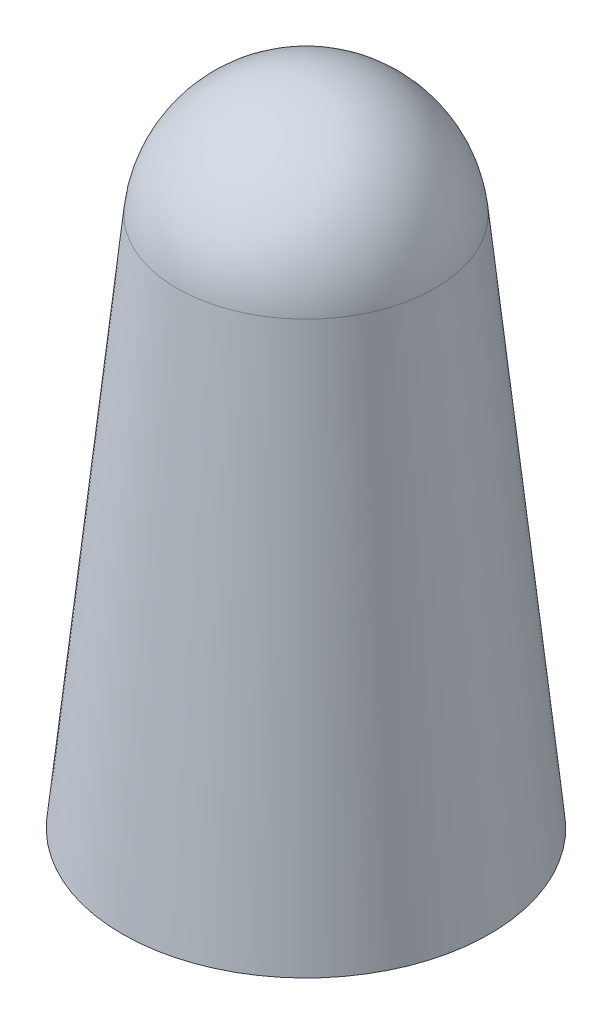
ISO-10303-21;
HEADER;
FILE_DESCRIPTION(('STEP AP214'),'2;1');
FILE_NAME('part.step','',(''),(''),'','','');
FILE_SCHEMA(('AUTOMOTIVE_DESIGN { 1 0 10303 214 1 1 1 1 }'));
ENDSEC;
DATA;
#1=APPLICATION_CONTEXT('core data for automotive mechanical design processes');
#2=APPLICATION_PROTOCOL_DEFINITION('international standard','automotive_design',2000,#1);
#3=PRODUCT_CONTEXT('',#1,'mechanical');
#4=PRODUCT('Part','Part','',(#3));
#5=PRODUCT_RELATED_PRODUCT_CATEGORY('part','',(#4));
#6=PRODUCT_DEFINITION_FORMATION('','',#4);
#7=PRODUCT_DEFINITION_CONTEXT('part definition',#1,'design');
#8=PRODUCT_DEFINITION('design','',#6,#7);
#9=PRODUCT_DEFINITION_SHAPE('','',#8);
#10=(LENGTH_UNIT() NAMED_UNIT(*) SI_UNIT(.MILLI.,.METRE.));
#11=(NAMED_UNIT(*) PLANE_ANGLE_UNIT() SI_UNIT($,.RADIAN.));
#12=(NAMED_UNIT(*) SI_UNIT($,.STERADIAN.) SOLID_ANGLE_UNIT());
#13=UNCERTAINTY_MEASURE_WITH_UNIT(LENGTH_MEASURE(1.E-05),#10,'distance_accuracy_value','');
#14=(GEOMETRIC_REPRESENTATION_CONTEXT(3) GLOBAL_UNCERTAINTY_ASSIGNED_CONTEXT((#13)) GLOBAL_UNIT_ASSIGNED_CONTEXT((#10,
#11,#12)) REPRESENTATION_CONTEXT('',''));
#15=CARTESIAN_POINT('',(0.,0.,0.));
#16=DIRECTION('',(0.,0.,1.));
#17=DIRECTION('',(1.,0.,0.));
#18=AXIS2_PLACEMENT_3D('',#15,#16,#17);
#19=CARTESIAN_POINT('',(0.,0.,0.));
#20=DIRECTION('',(0.,-1.,0.));
#21=DIRECTION('',(0.,0.,-1.));
#22=AXIS2_PLACEMENT_3D('',#19,#20,#21);
#23=CYLINDRICAL_SURFACE('',#22,2.5);
#24=CARTESIAN_POINT('',(0.,6.,0.));
#25=DIRECTION('',(0.,-1.,0.));
#26=DIRECTION('',(0.,0.,-1.));
#27=AXIS2_PLACEMENT_3D('',#24,#25,#26);
#28=CIRCLE('',#27,2.5);
#29=CARTESIAN_POINT('',(0.,6.,-2.5));
#30=VERTEX_POINT('',#29);
#31=EDGE_CURVE('E10',#30,#30,#28,.T.);
#32=ORIENTED_EDGE('',*,*,#31,.F.);
#33=EDGE_LOOP('',(#32));
#34=FACE_BOUND('',#33,.T.);
#35=CARTESIAN_POINT('',(0.,0.,0.));
#36=DIRECTION('',(0.,-1.,0.));
#37=DIRECTION('',(0.,0.,-1.));
#38=AXIS2_PLACEMENT_3D('',#35,#36,#37);
#39=CIRCLE('',#38,2.5);
#40=CARTESIAN_POINT('',(0.,0.,-2.5));
#41=VERTEX_POINT('',#40);
#42=EDGE_CURVE('E46',#41,#41,#39,.T.);
#43=ORIENTED_EDGE('',*,*,#42,.T.);
#44=EDGE_LOOP('',(#43));
#45=FACE_BOUND('',#44,.T.);
#46=ADVANCED_FACE('F24',(#34,#45),#23,.F.);
#47=CARTESIAN_POINT('',(-2.5,6.,0.));
#48=DIRECTION('',(0.,1.,0.));
#49=DIRECTION('',(0.,0.,1.));
#50=AXIS2_PLACEMENT_3D('',#47,#48,#49);
#51=PLANE('',#50);
#52=CARTESIAN_POINT('',(0.,6.,0.));
#53=DIRECTION('',(0.,-1.,0.));
#54=DIRECTION('',(0.,0.,-1.));
#55=AXIS2_PLACEMENT_3D('',#52,#53,#54);
#56=CIRCLE('',#55,2.);
#57=CARTESIAN_POINT('',(0.,6.,-2.));
#58=VERTEX_POINT('',#57);
#59=EDGE_CURVE('E30',#58,#58,#56,.T.);
#60=ORIENTED_EDGE('',*,*,#59,.F.);
#61=EDGE_LOOP('',(#60));
#62=FACE_BOUND('',#61,.T.);
#63=ORIENTED_EDGE('',*,*,#31,.T.);
#64=EDGE_LOOP('',(#63));
#65=FACE_BOUND('',#64,.T.);
#66=ADVANCED_FACE('F74',(#62,#65),#51,.F.);
#67=CARTESIAN_POINT('',(0.,0.,0.));
#68=DIRECTION('',(0.,-1.,0.));
#69=DIRECTION('',(0.,0.,-1.));
#70=AXIS2_PLACEMENT_3D('',#67,#68,#69);
#71=CYLINDRICAL_SURFACE('',#70,2.);
#72=CARTESIAN_POINT('',(0.,12.,0.));
#73=DIRECTION('',(0.,-1.,0.));
#74=DIRECTION('',(0.,0.,-1.));
#75=AXIS2_PLACEMENT_3D('',#72,#73,#74);
#76=CIRCLE('',#75,2.);
#77=CARTESIAN_POINT('',(0.,12.,-2.));
#78=VERTEX_POINT('',#77);
#79=EDGE_CURVE('E34',#78,#78,#76,.T.);
#80=ORIENTED_EDGE('',*,*,#79,.F.);
#81=EDGE_LOOP('',(#80));
#82=FACE_BOUND('',#81,.T.);
#83=ORIENTED_EDGE('',*,*,#59,.T.);
#84=EDGE_LOOP('',(#83));
#85=FACE_BOUND('',#84,.T.);
#86=ADVANCED_FACE('F70',(#82,#85),#71,.F.);
#87=CARTESIAN_POINT('',(0.,12.,0.));
#88=DIRECTION('',(0.,-1.,0.));
#89=DIRECTION('',(-1.,0.,0.));
#90=AXIS2_PLACEMENT_3D('',#87,#88,#89);
#91=SPHERICAL_SURFACE('',#90,2.);
#92=ORIENTED_EDGE('',*,*,#79,.T.);
#93=EDGE_LOOP('',(#92));
#94=FACE_BOUND('',#93,.T.);
#95=ADVANCED_FACE('F65',(#94),#91,.F.);
#96=CARTESIAN_POINT('',(0.,12.,0.));
#97=DIRECTION('',(0.,-1.,0.));
#98=DIRECTION('',(1.,0.,0.));
#99=AXIS2_PLACEMENT_3D('',#96,#97,#98);
#100=SPHERICAL_SURFACE('',#99,3.);
#101=CARTESIAN_POINT('',(0.,12.3069247892242,0.));
#102=DIRECTION('',(0.,-1.,0.));
#103=DIRECTION('',(0.,0.,-1.));
#104=AXIS2_PLACEMENT_3D('',#101,#102,#103);
#105=CIRCLE('',#104,2.98425822839775);
#106=CARTESIAN_POINT('',(0.,12.3069247892242,-2.98425822839775));
#107=VERTEX_POINT('',#106);
#108=EDGE_CURVE('E38',#107,#107,#105,.T.);
#109=ORIENTED_EDGE('',*,*,#108,.F.);
#110=EDGE_LOOP('',(#109));
#111=FACE_BOUND('',#110,.T.);
#112=ADVANCED_FACE('F60',(#111),#100,.T.);
#113=CARTESIAN_POINT('',(0.,12.3069247892242,0.));
#114=DIRECTION('',(0.,-1.,0.));
#115=DIRECTION('',(0.,0.,-1.));
#116=AXIS2_PLACEMENT_3D('',#113,#114,#115);
#117=CONICAL_SURFACE('',#116,2.98425822839775,0.102487585434831);
#118=CARTESIAN_POINT('',(0.,0.,0.));
#119=DIRECTION('',(0.,-1.,0.));
#120=DIRECTION('',(0.,0.,-1.));
#121=AXIS2_PLACEMENT_3D('',#118,#119,#120);
#122=CIRCLE('',#121,4.25);
#123=CARTESIAN_POINT('',(0.,0.,-4.25));
#124=VERTEX_POINT('',#123);
#125=EDGE_CURVE('E43',#124,#124,#122,.T.);
#126=ORIENTED_EDGE('',*,*,#125,.F.);
#127=EDGE_LOOP('',(#126));
#128=FACE_BOUND('',#127,.T.);
#129=ORIENTED_EDGE('',*,*,#108,.T.);
#130=EDGE_LOOP('',(#129));
#131=FACE_BOUND('',#130,.T.);
#132=ADVANCED_FACE('F54',(#128,#131),#117,.T.);
#133=CARTESIAN_POINT('',(-2.5,0.,0.));
#134=DIRECTION('',(0.,1.,0.));
#135=DIRECTION('',(0.,0.,1.));
#136=AXIS2_PLACEMENT_3D('',#133,#134,#135);
#137=PLANE('',#136);
#138=ORIENTED_EDGE('',*,*,#42,.F.);
#139=EDGE_LOOP('',(#138));
#140=FACE_BOUND('',#139,.T.);
#141=ORIENTED_EDGE('',*,*,#125,.T.);
#142=EDGE_LOOP('',(#141));
#143=FACE_BOUND('',#142,.T.);
#144=ADVANCED_FACE('F51',(#140,#143),#137,.F.);
#145=CLOSED_SHELL('',(#46,#66,#86,#95,#112,#132,#144));
#146=MANIFOLD_SOLID_BREP('B2',#145);
#147=ADVANCED_BREP_SHAPE_REPRESENTATION('',(#18,#146),#14);
#148=SHAPE_DEFINITION_REPRESENTATION(#9,#147);
ENDSEC;
END-ISO-10303-21;
